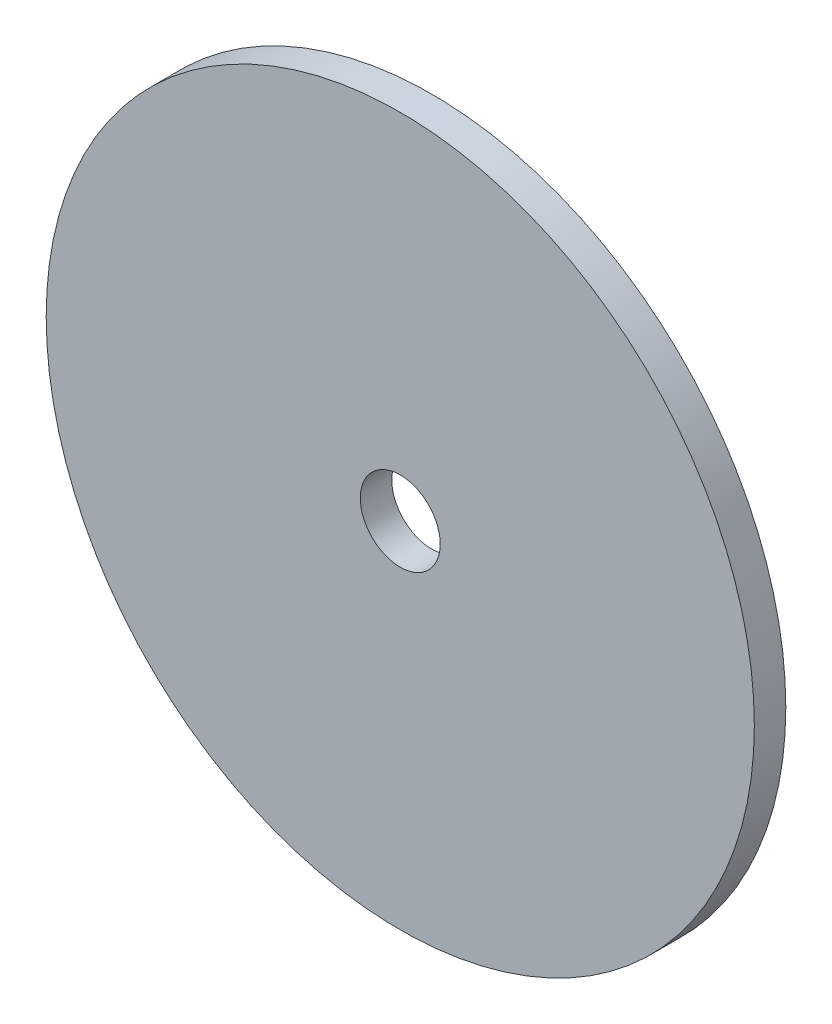
ISO-10303-21;
HEADER;
FILE_DESCRIPTION(('STEP AP214'),'2;1');
FILE_NAME('part.step','',(''),(''),'','','');
FILE_SCHEMA(('AUTOMOTIVE_DESIGN { 1 0 10303 214 1 1 1 1 }'));
ENDSEC;
DATA;
#1=APPLICATION_CONTEXT('core data for automotive mechanical design processes');
#2=APPLICATION_PROTOCOL_DEFINITION('international standard','automotive_design',2000,#1);
#3=PRODUCT_CONTEXT('',#1,'mechanical');
#4=PRODUCT('Part','Part','',(#3));
#5=PRODUCT_RELATED_PRODUCT_CATEGORY('part','',(#4));
#6=PRODUCT_DEFINITION_FORMATION('','',#4);
#7=PRODUCT_DEFINITION_CONTEXT('part definition',#1,'design');
#8=PRODUCT_DEFINITION('design','',#6,#7);
#9=PRODUCT_DEFINITION_SHAPE('','',#8);
#10=(LENGTH_UNIT() NAMED_UNIT(*) SI_UNIT(.MILLI.,.METRE.));
#11=(NAMED_UNIT(*) PLANE_ANGLE_UNIT() SI_UNIT($,.RADIAN.));
#12=(NAMED_UNIT(*) SI_UNIT($,.STERADIAN.) SOLID_ANGLE_UNIT());
#13=UNCERTAINTY_MEASURE_WITH_UNIT(LENGTH_MEASURE(1.E-05),#10,'distance_accuracy_value','');
#14=(GEOMETRIC_REPRESENTATION_CONTEXT(3) GLOBAL_UNCERTAINTY_ASSIGNED_CONTEXT((#13)) GLOBAL_UNIT_ASSIGNED_CONTEXT((#10,
#11,#12)) REPRESENTATION_CONTEXT('',''));
#15=CARTESIAN_POINT('',(0.,0.,0.));
#16=DIRECTION('',(0.,0.,1.));
#17=DIRECTION('',(1.,0.,0.));
#18=AXIS2_PLACEMENT_3D('',#15,#16,#17);
#19=CARTESIAN_POINT('',(0.,0.,20.));
#20=DIRECTION('',(0.,0.,1.));
#21=DIRECTION('',(1.,0.,0.));
#22=AXIS2_PLACEMENT_3D('',#19,#20,#21);
#23=PLANE('',#22);
#24=CARTESIAN_POINT('',(0.,0.,20.));
#25=DIRECTION('',(0.,0.,1.));
#26=DIRECTION('',(1.,0.,0.));
#27=AXIS2_PLACEMENT_3D('',#24,#25,#26);
#28=CIRCLE('',#27,225.);
#29=CARTESIAN_POINT('',(225.,0.,20.));
#30=VERTEX_POINT('',#29);
#31=EDGE_CURVE('E10',#30,#30,#28,.T.);
#32=ORIENTED_EDGE('',*,*,#31,.T.);
#33=EDGE_LOOP('',(#32));
#34=FACE_BOUND('',#33,.T.);
#35=CARTESIAN_POINT('',(0.,0.,20.));
#36=DIRECTION('',(0.,0.,1.));
#37=DIRECTION('',(1.,0.,0.));
#38=AXIS2_PLACEMENT_3D('',#35,#36,#37);
#39=CIRCLE('',#38,25.4);
#40=CARTESIAN_POINT('',(25.4,0.,20.));
#41=VERTEX_POINT('',#40);
#42=EDGE_CURVE('E42',#41,#41,#39,.T.);
#43=ORIENTED_EDGE('',*,*,#42,.F.);
#44=EDGE_LOOP('',(#43));
#45=FACE_BOUND('',#44,.T.);
#46=ADVANCED_FACE('F31',(#34,#45),#23,.T.);
#47=CARTESIAN_POINT('',(0.,0.,0.));
#48=DIRECTION('',(0.,0.,1.));
#49=DIRECTION('',(1.,0.,0.));
#50=AXIS2_PLACEMENT_3D('',#47,#48,#49);
#51=PLANE('',#50);
#52=CARTESIAN_POINT('',(0.,0.,0.));
#53=DIRECTION('',(0.,0.,1.));
#54=DIRECTION('',(1.,0.,0.));
#55=AXIS2_PLACEMENT_3D('',#52,#53,#54);
#56=CIRCLE('',#55,225.);
#57=CARTESIAN_POINT('',(225.,0.,0.));
#58=VERTEX_POINT('',#57);
#59=EDGE_CURVE('E35',#58,#58,#56,.T.);
#60=ORIENTED_EDGE('',*,*,#59,.F.);
#61=EDGE_LOOP('',(#60));
#62=FACE_BOUND('',#61,.T.);
#63=CARTESIAN_POINT('',(0.,0.,0.));
#64=DIRECTION('',(0.,0.,1.));
#65=DIRECTION('',(1.,0.,0.));
#66=AXIS2_PLACEMENT_3D('',#63,#64,#65);
#67=CIRCLE('',#66,25.4);
#68=CARTESIAN_POINT('',(25.4,0.,0.));
#69=VERTEX_POINT('',#68);
#70=EDGE_CURVE('E44',#69,#69,#67,.T.);
#71=ORIENTED_EDGE('',*,*,#70,.T.);
#72=EDGE_LOOP('',(#71));
#73=FACE_BOUND('',#72,.T.);
#74=ADVANCED_FACE('F54',(#62,#73),#51,.F.);
#75=CARTESIAN_POINT('',(0.,0.,20.));
#76=DIRECTION('',(0.,0.,-1.));
#77=DIRECTION('',(-1.,0.,0.));
#78=AXIS2_PLACEMENT_3D('',#75,#76,#77);
#79=CYLINDRICAL_SURFACE('',#78,225.);
#80=ORIENTED_EDGE('',*,*,#31,.F.);
#81=EDGE_LOOP('',(#80));
#82=FACE_BOUND('',#81,.T.);
#83=ORIENTED_EDGE('',*,*,#59,.T.);
#84=EDGE_LOOP('',(#83));
#85=FACE_BOUND('',#84,.T.);
#86=ADVANCED_FACE('F33',(#82,#85),#79,.T.);
#87=CARTESIAN_POINT('',(0.,0.,20.));
#88=DIRECTION('',(0.,0.,-1.));
#89=DIRECTION('',(-1.,0.,0.));
#90=AXIS2_PLACEMENT_3D('',#87,#88,#89);
#91=CYLINDRICAL_SURFACE('',#90,25.4);
#92=ORIENTED_EDGE('',*,*,#42,.T.);
#93=EDGE_LOOP('',(#92));
#94=FACE_BOUND('',#93,.T.);
#95=ORIENTED_EDGE('',*,*,#70,.F.);
#96=EDGE_LOOP('',(#95));
#97=FACE_BOUND('',#96,.T.);
#98=ADVANCED_FACE('F50',(#94,#97),#91,.F.);
#99=CLOSED_SHELL('',(#46,#74,#86,#98));
#100=MANIFOLD_SOLID_BREP('B2',#99);
#101=ADVANCED_BREP_SHAPE_REPRESENTATION('',(#18,#100),#14);
#102=SHAPE_DEFINITION_REPRESENTATION(#9,#101);
ENDSEC;
END-ISO-10303-21;
